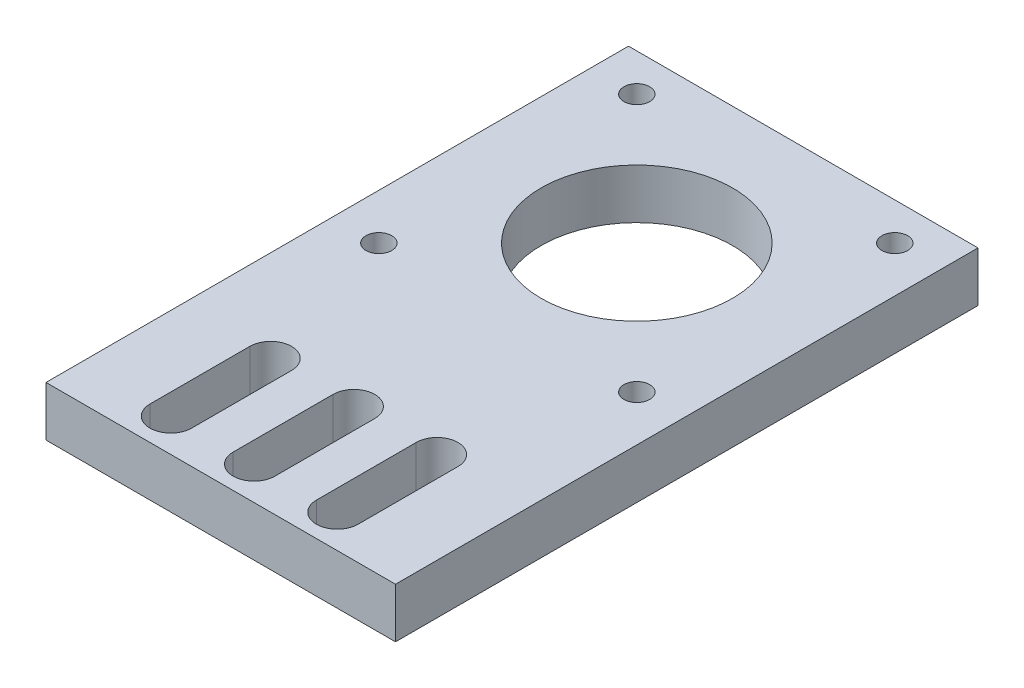
ISO-10303-21;
HEADER;
FILE_DESCRIPTION(('STEP AP214'),'2;1');
FILE_NAME('part.step','',(''),(''),'','','');
FILE_SCHEMA(('AUTOMOTIVE_DESIGN { 1 0 10303 214 1 1 1 1 }'));
ENDSEC;
DATA;
#1=APPLICATION_CONTEXT('core data for automotive mechanical design processes');
#2=APPLICATION_PROTOCOL_DEFINITION('international standard','automotive_design',2000,#1);
#3=PRODUCT_CONTEXT('',#1,'mechanical');
#4=PRODUCT('Part','Part','',(#3));
#5=PRODUCT_RELATED_PRODUCT_CATEGORY('part','',(#4));
#6=PRODUCT_DEFINITION_FORMATION('','',#4);
#7=PRODUCT_DEFINITION_CONTEXT('part definition',#1,'design');
#8=PRODUCT_DEFINITION('design','',#6,#7);
#9=PRODUCT_DEFINITION_SHAPE('','',#8);
#10=(LENGTH_UNIT() NAMED_UNIT(*) SI_UNIT(.MILLI.,.METRE.));
#11=(NAMED_UNIT(*) PLANE_ANGLE_UNIT() SI_UNIT($,.RADIAN.));
#12=(NAMED_UNIT(*) SI_UNIT($,.STERADIAN.) SOLID_ANGLE_UNIT());
#13=UNCERTAINTY_MEASURE_WITH_UNIT(LENGTH_MEASURE(1.E-05),#10,'distance_accuracy_value','');
#14=(GEOMETRIC_REPRESENTATION_CONTEXT(3) GLOBAL_UNCERTAINTY_ASSIGNED_CONTEXT((#13)) GLOBAL_UNIT_ASSIGNED_CONTEXT((#10,
#11,#12)) REPRESENTATION_CONTEXT('',''));
#15=CARTESIAN_POINT('',(0.,0.,0.));
#16=DIRECTION('',(0.,0.,1.));
#17=DIRECTION('',(1.,0.,0.));
#18=AXIS2_PLACEMENT_3D('',#15,#16,#17);
#19=CARTESIAN_POINT('',(0.,6.,0.));
#20=DIRECTION('',(0.,-1.,0.));
#21=DIRECTION('',(0.,0.,-1.));
#22=AXIS2_PLACEMENT_3D('',#19,#20,#21);
#23=PLANE('',#22);
#24=CARTESIAN_POINT('',(0.,6.,19.));
#25=DIRECTION('',(0.,1.,0.));
#26=DIRECTION('',(0.,0.,-1.));
#27=AXIS2_PLACEMENT_3D('',#24,#25,#26);
#28=CIRCLE('',#27,2.51);
#29=CARTESIAN_POINT('',(2.51,6.,19.));
#30=VERTEX_POINT('',#29);
#31=CARTESIAN_POINT('',(-2.51,6.,19.));
#32=VERTEX_POINT('',#31);
#33=EDGE_CURVE('E181',#30,#32,#28,.T.);
#34=ORIENTED_EDGE('',*,*,#33,.F.);
#35=DIRECTION('',(0.,0.,-1.));
#36=VECTOR('',#35,1.);
#37=CARTESIAN_POINT('',(2.51,6.,31.));
#38=LINE('',#37,#36);
#39=CARTESIAN_POINT('',(2.51,6.,31.));
#40=VERTEX_POINT('',#39);
#41=EDGE_CURVE('E189',#40,#30,#38,.T.);
#42=ORIENTED_EDGE('',*,*,#41,.F.);
#43=CARTESIAN_POINT('',(0.,6.,31.));
#44=DIRECTION('',(0.,1.,0.));
#45=DIRECTION('',(0.,0.,1.));
#46=AXIS2_PLACEMENT_3D('',#43,#44,#45);
#47=CIRCLE('',#46,2.51);
#48=CARTESIAN_POINT('',(-2.50999999999999,6.,31.));
#49=VERTEX_POINT('',#48);
#50=EDGE_CURVE('E186',#49,#40,#47,.T.);
#51=ORIENTED_EDGE('',*,*,#50,.F.);
#52=DIRECTION('',(0.,0.,1.));
#53=VECTOR('',#52,1.);
#54=CARTESIAN_POINT('',(-2.51,6.,31.));
#55=LINE('',#54,#53);
#56=EDGE_CURVE('E183',#32,#49,#55,.T.);
#57=ORIENTED_EDGE('',*,*,#56,.F.);
#58=EDGE_LOOP('',(#34,#42,#51,#57));
#59=FACE_BOUND('',#58,.T.);
#60=CARTESIAN_POINT('',(-15.5,6.,0.499999999999997));
#61=DIRECTION('',(0.,1.,0.));
#62=DIRECTION('',(0.,0.,1.));
#63=AXIS2_PLACEMENT_3D('',#60,#61,#62);
#64=CIRCLE('',#63,1.55);
#65=CARTESIAN_POINT('',(-15.5,6.,2.05));
#66=VERTEX_POINT('',#65);
#67=EDGE_CURVE('E243',#66,#66,#64,.T.);
#68=ORIENTED_EDGE('',*,*,#67,.F.);
#69=EDGE_LOOP('',(#68));
#70=FACE_BOUND('',#69,.T.);
#71=CARTESIAN_POINT('',(15.5,6.,0.499999999999994));
#72=DIRECTION('',(0.,1.,0.));
#73=DIRECTION('',(0.,0.,1.));
#74=AXIS2_PLACEMENT_3D('',#71,#72,#73);
#75=CIRCLE('',#74,1.55);
#76=CARTESIAN_POINT('',(15.5,6.,2.05));
#77=VERTEX_POINT('',#76);
#78=EDGE_CURVE('E249',#77,#77,#75,.T.);
#79=ORIENTED_EDGE('',*,*,#78,.F.);
#80=EDGE_LOOP('',(#79));
#81=FACE_BOUND('',#80,.T.);
#82=CARTESIAN_POINT('',(15.5,6.,-30.5));
#83=DIRECTION('',(0.,1.,0.));
#84=DIRECTION('',(0.,0.,1.));
#85=AXIS2_PLACEMENT_3D('',#82,#83,#84);
#86=CIRCLE('',#85,1.55);
#87=CARTESIAN_POINT('',(15.5,6.,-28.95));
#88=VERTEX_POINT('',#87);
#89=EDGE_CURVE('E255',#88,#88,#86,.T.);
#90=ORIENTED_EDGE('',*,*,#89,.F.);
#91=EDGE_LOOP('',(#90));
#92=FACE_BOUND('',#91,.T.);
#93=CARTESIAN_POINT('',(-15.5,6.,-30.5));
#94=DIRECTION('',(0.,1.,0.));
#95=DIRECTION('',(0.,0.,1.));
#96=AXIS2_PLACEMENT_3D('',#93,#94,#95);
#97=CIRCLE('',#96,1.55);
#98=CARTESIAN_POINT('',(-15.5,6.,-28.95));
#99=VERTEX_POINT('',#98);
#100=EDGE_CURVE('E261',#99,#99,#97,.T.);
#101=ORIENTED_EDGE('',*,*,#100,.F.);
#102=EDGE_LOOP('',(#101));
#103=FACE_BOUND('',#102,.T.);
#104=CARTESIAN_POINT('',(0.,6.,-15.));
#105=DIRECTION('',(0.,1.,0.));
#106=DIRECTION('',(0.,0.,1.));
#107=AXIS2_PLACEMENT_3D('',#104,#105,#106);
#108=CIRCLE('',#107,11.5);
#109=CARTESIAN_POINT('',(0.,6.,-3.49999999999999));
#110=VERTEX_POINT('',#109);
#111=EDGE_CURVE('E267',#110,#110,#108,.T.);
#112=ORIENTED_EDGE('',*,*,#111,.F.);
#113=EDGE_LOOP('',(#112));
#114=FACE_BOUND('',#113,.T.);
#115=DIRECTION('',(0.,0.,-1.));
#116=VECTOR('',#115,1.);
#117=CARTESIAN_POINT('',(21.,6.,35.));
#118=LINE('',#117,#116);
#119=CARTESIAN_POINT('',(21.,6.,35.));
#120=VERTEX_POINT('',#119);
#121=CARTESIAN_POINT('',(21.,6.,-35.));
#122=VERTEX_POINT('',#121);
#123=EDGE_CURVE('E273',#120,#122,#118,.T.);
#124=ORIENTED_EDGE('',*,*,#123,.T.);
#125=DIRECTION('',(-1.,0.,0.));
#126=VECTOR('',#125,1.);
#127=CARTESIAN_POINT('',(-21.,6.,-35.));
#128=LINE('',#127,#126);
#129=CARTESIAN_POINT('',(-21.,6.,-35.));
#130=VERTEX_POINT('',#129);
#131=EDGE_CURVE('E276',#122,#130,#128,.T.);
#132=ORIENTED_EDGE('',*,*,#131,.T.);
#133=DIRECTION('',(0.,0.,1.));
#134=VECTOR('',#133,1.);
#135=CARTESIAN_POINT('',(-21.,6.,35.));
#136=LINE('',#135,#134);
#137=CARTESIAN_POINT('',(-21.,6.,35.));
#138=VERTEX_POINT('',#137);
#139=EDGE_CURVE('E279',#130,#138,#136,.T.);
#140=ORIENTED_EDGE('',*,*,#139,.T.);
#141=DIRECTION('',(1.,0.,0.));
#142=VECTOR('',#141,1.);
#143=CARTESIAN_POINT('',(-21.,6.,35.));
#144=LINE('',#143,#142);
#145=EDGE_CURVE('E281',#138,#120,#144,.T.);
#146=ORIENTED_EDGE('',*,*,#145,.T.);
#147=EDGE_LOOP('',(#124,#132,#140,#146));
#148=FACE_BOUND('',#147,.T.);
#149=CARTESIAN_POINT('',(-9.99999999999999,6.,19.));
#150=DIRECTION('',(0.,1.,0.));
#151=DIRECTION('',(0.,0.,-1.));
#152=AXIS2_PLACEMENT_3D('',#149,#150,#151);
#153=CIRCLE('',#152,2.51);
#154=CARTESIAN_POINT('',(-7.49,6.,19.));
#155=VERTEX_POINT('',#154);
#156=CARTESIAN_POINT('',(-12.51,6.,19.));
#157=VERTEX_POINT('',#156);
#158=EDGE_CURVE('E212',#155,#157,#153,.T.);
#159=ORIENTED_EDGE('',*,*,#158,.F.);
#160=DIRECTION('',(0.,0.,-1.));
#161=VECTOR('',#160,1.);
#162=CARTESIAN_POINT('',(-7.49,6.,31.));
#163=LINE('',#162,#161);
#164=CARTESIAN_POINT('',(-7.49,6.,31.));
#165=VERTEX_POINT('',#164);
#166=EDGE_CURVE('E220',#165,#155,#163,.T.);
#167=ORIENTED_EDGE('',*,*,#166,.F.);
#168=CARTESIAN_POINT('',(-9.99999999999999,6.,31.));
#169=DIRECTION('',(0.,1.,0.));
#170=DIRECTION('',(0.,0.,1.));
#171=AXIS2_PLACEMENT_3D('',#168,#169,#170);
#172=CIRCLE('',#171,2.51);
#173=CARTESIAN_POINT('',(-12.51,6.,31.));
#174=VERTEX_POINT('',#173);
#175=EDGE_CURVE('E217',#174,#165,#172,.T.);
#176=ORIENTED_EDGE('',*,*,#175,.F.);
#177=DIRECTION('',(0.,0.,1.));
#178=VECTOR('',#177,1.);
#179=CARTESIAN_POINT('',(-12.51,6.,31.));
#180=LINE('',#179,#178);
#181=EDGE_CURVE('E214',#157,#174,#180,.T.);
#182=ORIENTED_EDGE('',*,*,#181,.F.);
#183=EDGE_LOOP('',(#159,#167,#176,#182));
#184=FACE_BOUND('',#183,.T.);
#185=CARTESIAN_POINT('',(10.,6.,19.));
#186=DIRECTION('',(0.,1.,0.));
#187=DIRECTION('',(0.,0.,-1.));
#188=AXIS2_PLACEMENT_3D('',#185,#186,#187);
#189=CIRCLE('',#188,2.51);
#190=CARTESIAN_POINT('',(12.51,6.,19.));
#191=VERTEX_POINT('',#190);
#192=CARTESIAN_POINT('',(7.49,6.,19.));
#193=VERTEX_POINT('',#192);
#194=EDGE_CURVE('E145',#191,#193,#189,.T.);
#195=ORIENTED_EDGE('',*,*,#194,.F.);
#196=DIRECTION('',(0.,0.,-1.));
#197=VECTOR('',#196,1.);
#198=CARTESIAN_POINT('',(12.51,6.,31.));
#199=LINE('',#198,#197);
#200=CARTESIAN_POINT('',(12.51,6.,31.));
#201=VERTEX_POINT('',#200);
#202=EDGE_CURVE('E167',#201,#191,#199,.T.);
#203=ORIENTED_EDGE('',*,*,#202,.F.);
#204=CARTESIAN_POINT('',(10.,6.,31.));
#205=DIRECTION('',(0.,1.,0.));
#206=DIRECTION('',(0.,0.,1.));
#207=AXIS2_PLACEMENT_3D('',#204,#205,#206);
#208=CIRCLE('',#207,2.51);
#209=CARTESIAN_POINT('',(7.49000000000001,6.,31.));
#210=VERTEX_POINT('',#209);
#211=EDGE_CURVE('E165',#210,#201,#208,.T.);
#212=ORIENTED_EDGE('',*,*,#211,.F.);
#213=DIRECTION('',(0.,0.,1.));
#214=VECTOR('',#213,1.);
#215=CARTESIAN_POINT('',(7.49,6.,31.));
#216=LINE('',#215,#214);
#217=EDGE_CURVE('E153',#193,#210,#216,.T.);
#218=ORIENTED_EDGE('',*,*,#217,.F.);
#219=EDGE_LOOP('',(#195,#203,#212,#218));
#220=FACE_BOUND('',#219,.T.);
#221=ADVANCED_FACE('F32',(#59,#70,#81,#92,#103,#114,#148,#184,#220),#23,.F.);
#222=CARTESIAN_POINT('',(0.,0.,0.));
#223=DIRECTION('',(0.,-1.,0.));
#224=DIRECTION('',(0.,0.,-1.));
#225=AXIS2_PLACEMENT_3D('',#222,#223,#224);
#226=PLANE('',#225);
#227=CARTESIAN_POINT('',(15.5,0.,0.499999999999994));
#228=DIRECTION('',(0.,1.,0.));
#229=DIRECTION('',(0.,0.,1.));
#230=AXIS2_PLACEMENT_3D('',#227,#228,#229);
#231=CIRCLE('',#230,1.55);
#232=CARTESIAN_POINT('',(15.5,0.,2.05));
#233=VERTEX_POINT('',#232);
#234=EDGE_CURVE('E246',#233,#233,#231,.T.);
#235=ORIENTED_EDGE('',*,*,#234,.T.);
#236=EDGE_LOOP('',(#235));
#237=FACE_BOUND('',#236,.T.);
#238=CARTESIAN_POINT('',(-15.5,0.,-30.5));
#239=DIRECTION('',(0.,1.,0.));
#240=DIRECTION('',(0.,0.,1.));
#241=AXIS2_PLACEMENT_3D('',#238,#239,#240);
#242=CIRCLE('',#241,1.55);
#243=CARTESIAN_POINT('',(-15.5,0.,-28.95));
#244=VERTEX_POINT('',#243);
#245=EDGE_CURVE('E258',#244,#244,#242,.T.);
#246=ORIENTED_EDGE('',*,*,#245,.T.);
#247=EDGE_LOOP('',(#246));
#248=FACE_BOUND('',#247,.T.);
#249=DIRECTION('',(0.,0.,-1.));
#250=VECTOR('',#249,1.);
#251=CARTESIAN_POINT('',(21.,0.,35.));
#252=LINE('',#251,#250);
#253=CARTESIAN_POINT('',(21.,0.,35.));
#254=VERTEX_POINT('',#253);
#255=CARTESIAN_POINT('',(21.,0.,-35.));
#256=VERTEX_POINT('',#255);
#257=EDGE_CURVE('E270',#254,#256,#252,.T.);
#258=ORIENTED_EDGE('',*,*,#257,.F.);
#259=DIRECTION('',(1.,0.,0.));
#260=VECTOR('',#259,1.);
#261=CARTESIAN_POINT('',(-21.,0.,35.));
#262=LINE('',#261,#260);
#263=CARTESIAN_POINT('',(-21.,0.,35.));
#264=VERTEX_POINT('',#263);
#265=EDGE_CURVE('E277',#264,#254,#262,.T.);
#266=ORIENTED_EDGE('',*,*,#265,.F.);
#267=DIRECTION('',(0.,0.,1.));
#268=VECTOR('',#267,1.);
#269=CARTESIAN_POINT('',(-21.,0.,35.));
#270=LINE('',#269,#268);
#271=CARTESIAN_POINT('',(-21.,0.,-35.));
#272=VERTEX_POINT('',#271);
#273=EDGE_CURVE('E288',#272,#264,#270,.T.);
#274=ORIENTED_EDGE('',*,*,#273,.F.);
#275=DIRECTION('',(-1.,0.,0.));
#276=VECTOR('',#275,1.);
#277=CARTESIAN_POINT('',(-21.,0.,-35.));
#278=LINE('',#277,#276);
#279=EDGE_CURVE('E286',#256,#272,#278,.T.);
#280=ORIENTED_EDGE('',*,*,#279,.F.);
#281=EDGE_LOOP('',(#258,#266,#274,#280));
#282=FACE_BOUND('',#281,.T.);
#283=CARTESIAN_POINT('',(0.,0.,-15.));
#284=DIRECTION('',(0.,1.,0.));
#285=DIRECTION('',(0.,0.,1.));
#286=AXIS2_PLACEMENT_3D('',#283,#284,#285);
#287=CIRCLE('',#286,11.5);
#288=CARTESIAN_POINT('',(0.,0.,-3.49999999999999));
#289=VERTEX_POINT('',#288);
#290=EDGE_CURVE('E264',#289,#289,#287,.T.);
#291=ORIENTED_EDGE('',*,*,#290,.T.);
#292=EDGE_LOOP('',(#291));
#293=FACE_BOUND('',#292,.T.);
#294=CARTESIAN_POINT('',(15.5,0.,-30.5));
#295=DIRECTION('',(0.,1.,0.));
#296=DIRECTION('',(0.,0.,1.));
#297=AXIS2_PLACEMENT_3D('',#294,#295,#296);
#298=CIRCLE('',#297,1.55);
#299=CARTESIAN_POINT('',(15.5,0.,-28.95));
#300=VERTEX_POINT('',#299);
#301=EDGE_CURVE('E252',#300,#300,#298,.T.);
#302=ORIENTED_EDGE('',*,*,#301,.T.);
#303=EDGE_LOOP('',(#302));
#304=FACE_BOUND('',#303,.T.);
#305=CARTESIAN_POINT('',(-15.5,0.,0.499999999999997));
#306=DIRECTION('',(0.,1.,0.));
#307=DIRECTION('',(0.,0.,1.));
#308=AXIS2_PLACEMENT_3D('',#305,#306,#307);
#309=CIRCLE('',#308,1.55);
#310=CARTESIAN_POINT('',(-15.5,0.,2.05));
#311=VERTEX_POINT('',#310);
#312=EDGE_CURVE('E242',#311,#311,#309,.T.);
#313=ORIENTED_EDGE('',*,*,#312,.T.);
#314=EDGE_LOOP('',(#313));
#315=FACE_BOUND('',#314,.T.);
#316=DIRECTION('',(0.,0.,-1.));
#317=VECTOR('',#316,1.);
#318=CARTESIAN_POINT('',(-7.49,0.,31.));
#319=LINE('',#318,#317);
#320=CARTESIAN_POINT('',(-7.48999999999999,0.,31.));
#321=VERTEX_POINT('',#320);
#322=CARTESIAN_POINT('',(-7.49,0.,19.));
#323=VERTEX_POINT('',#322);
#324=EDGE_CURVE('E215',#321,#323,#319,.T.);
#325=ORIENTED_EDGE('',*,*,#324,.T.);
#326=CARTESIAN_POINT('',(-9.99999999999999,0.,19.));
#327=DIRECTION('',(0.,1.,0.));
#328=DIRECTION('',(0.,0.,-1.));
#329=AXIS2_PLACEMENT_3D('',#326,#327,#328);
#330=CIRCLE('',#329,2.51);
#331=CARTESIAN_POINT('',(-12.51,0.,19.));
#332=VERTEX_POINT('',#331);
#333=EDGE_CURVE('E211',#323,#332,#330,.T.);
#334=ORIENTED_EDGE('',*,*,#333,.T.);
#335=DIRECTION('',(0.,0.,1.));
#336=VECTOR('',#335,1.);
#337=CARTESIAN_POINT('',(-12.51,0.,31.));
#338=LINE('',#337,#336);
#339=CARTESIAN_POINT('',(-12.51,0.,31.));
#340=VERTEX_POINT('',#339);
#341=EDGE_CURVE('E225',#332,#340,#338,.T.);
#342=ORIENTED_EDGE('',*,*,#341,.T.);
#343=CARTESIAN_POINT('',(-9.99999999999999,0.,31.));
#344=DIRECTION('',(0.,1.,0.));
#345=DIRECTION('',(0.,0.,1.));
#346=AXIS2_PLACEMENT_3D('',#343,#344,#345);
#347=CIRCLE('',#346,2.51);
#348=EDGE_CURVE('E228',#340,#321,#347,.T.);
#349=ORIENTED_EDGE('',*,*,#348,.T.);
#350=EDGE_LOOP('',(#325,#334,#342,#349));
#351=FACE_BOUND('',#350,.T.);
#352=DIRECTION('',(0.,0.,-1.));
#353=VECTOR('',#352,1.);
#354=CARTESIAN_POINT('',(2.51,0.,31.));
#355=LINE('',#354,#353);
#356=CARTESIAN_POINT('',(2.51,0.,31.));
#357=VERTEX_POINT('',#356);
#358=CARTESIAN_POINT('',(2.51,0.,19.));
#359=VERTEX_POINT('',#358);
#360=EDGE_CURVE('E184',#357,#359,#355,.T.);
#361=ORIENTED_EDGE('',*,*,#360,.T.);
#362=CARTESIAN_POINT('',(0.,0.,19.));
#363=DIRECTION('',(0.,1.,0.));
#364=DIRECTION('',(0.,0.,-1.));
#365=AXIS2_PLACEMENT_3D('',#362,#363,#364);
#366=CIRCLE('',#365,2.51);
#367=CARTESIAN_POINT('',(-2.51,0.,19.));
#368=VERTEX_POINT('',#367);
#369=EDGE_CURVE('E161',#359,#368,#366,.T.);
#370=ORIENTED_EDGE('',*,*,#369,.T.);
#371=DIRECTION('',(0.,0.,1.));
#372=VECTOR('',#371,1.);
#373=CARTESIAN_POINT('',(-2.51,0.,31.));
#374=LINE('',#373,#372);
#375=CARTESIAN_POINT('',(-2.50999999999999,0.,31.));
#376=VERTEX_POINT('',#375);
#377=EDGE_CURVE('E194',#368,#376,#374,.T.);
#378=ORIENTED_EDGE('',*,*,#377,.T.);
#379=CARTESIAN_POINT('',(0.,0.,31.));
#380=DIRECTION('',(0.,1.,0.));
#381=DIRECTION('',(0.,0.,1.));
#382=AXIS2_PLACEMENT_3D('',#379,#380,#381);
#383=CIRCLE('',#382,2.51);
#384=EDGE_CURVE('E197',#376,#357,#383,.T.);
#385=ORIENTED_EDGE('',*,*,#384,.T.);
#386=EDGE_LOOP('',(#361,#370,#378,#385));
#387=FACE_BOUND('',#386,.T.);
#388=DIRECTION('',(0.,0.,-1.));
#389=VECTOR('',#388,1.);
#390=CARTESIAN_POINT('',(12.51,0.,31.));
#391=LINE('',#390,#389);
#392=CARTESIAN_POINT('',(12.51,0.,31.));
#393=VERTEX_POINT('',#392);
#394=CARTESIAN_POINT('',(12.51,0.,19.));
#395=VERTEX_POINT('',#394);
#396=EDGE_CURVE('E154',#393,#395,#391,.T.);
#397=ORIENTED_EDGE('',*,*,#396,.T.);
#398=CARTESIAN_POINT('',(10.,0.,19.));
#399=DIRECTION('',(0.,1.,0.));
#400=DIRECTION('',(0.,0.,-1.));
#401=AXIS2_PLACEMENT_3D('',#398,#399,#400);
#402=CIRCLE('',#401,2.51);
#403=CARTESIAN_POINT('',(7.49,0.,19.));
#404=VERTEX_POINT('',#403);
#405=EDGE_CURVE('E55',#395,#404,#402,.T.);
#406=ORIENTED_EDGE('',*,*,#405,.T.);
#407=DIRECTION('',(0.,0.,1.));
#408=VECTOR('',#407,1.);
#409=CARTESIAN_POINT('',(7.49,0.,31.));
#410=LINE('',#409,#408);
#411=CARTESIAN_POINT('',(7.49000000000001,0.,31.));
#412=VERTEX_POINT('',#411);
#413=EDGE_CURVE('E160',#404,#412,#410,.T.);
#414=ORIENTED_EDGE('',*,*,#413,.T.);
#415=CARTESIAN_POINT('',(10.,0.,31.));
#416=DIRECTION('',(0.,1.,0.));
#417=DIRECTION('',(0.,0.,1.));
#418=AXIS2_PLACEMENT_3D('',#415,#416,#417);
#419=CIRCLE('',#418,2.51);
#420=EDGE_CURVE('E173',#412,#393,#419,.T.);
#421=ORIENTED_EDGE('',*,*,#420,.T.);
#422=EDGE_LOOP('',(#397,#406,#414,#421));
#423=FACE_BOUND('',#422,.T.);
#424=ADVANCED_FACE('F306',(#237,#248,#282,#293,#304,#315,#351,#387,#423),#226,.T.);
#425=CARTESIAN_POINT('',(21.,6.,35.));
#426=DIRECTION('',(-1.,0.,0.));
#427=DIRECTION('',(0.,0.,1.));
#428=AXIS2_PLACEMENT_3D('',#425,#426,#427);
#429=PLANE('',#428);
#430=ORIENTED_EDGE('',*,*,#257,.T.);
#431=DIRECTION('',(0.,-1.,0.));
#432=VECTOR('',#431,1.);
#433=CARTESIAN_POINT('',(21.,6.,-35.));
#434=LINE('',#433,#432);
#435=EDGE_CURVE('E11',#122,#256,#434,.T.);
#436=ORIENTED_EDGE('',*,*,#435,.F.);
#437=ORIENTED_EDGE('',*,*,#123,.F.);
#438=DIRECTION('',(0.,-1.,0.));
#439=VECTOR('',#438,1.);
#440=CARTESIAN_POINT('',(21.,6.,35.));
#441=LINE('',#440,#439);
#442=EDGE_CURVE('E283',#120,#254,#441,.T.);
#443=ORIENTED_EDGE('',*,*,#442,.T.);
#444=EDGE_LOOP('',(#430,#436,#437,#443));
#445=FACE_BOUND('',#444,.T.);
#446=ADVANCED_FACE('F34',(#445),#429,.F.);
#447=CARTESIAN_POINT('',(-21.,6.,-35.));
#448=DIRECTION('',(0.,0.,1.));
#449=DIRECTION('',(1.,0.,0.));
#450=AXIS2_PLACEMENT_3D('',#447,#448,#449);
#451=PLANE('',#450);
#452=ORIENTED_EDGE('',*,*,#279,.T.);
#453=DIRECTION('',(0.,-1.,0.));
#454=VECTOR('',#453,1.);
#455=CARTESIAN_POINT('',(-21.,6.,-35.));
#456=LINE('',#455,#454);
#457=EDGE_CURVE('E40',#130,#272,#456,.T.);
#458=ORIENTED_EDGE('',*,*,#457,.F.);
#459=ORIENTED_EDGE('',*,*,#131,.F.);
#460=ORIENTED_EDGE('',*,*,#435,.T.);
#461=EDGE_LOOP('',(#452,#458,#459,#460));
#462=FACE_BOUND('',#461,.T.);
#463=ADVANCED_FACE('F317',(#462),#451,.F.);
#464=CARTESIAN_POINT('',(-21.,6.,35.));
#465=DIRECTION('',(1.,0.,0.));
#466=DIRECTION('',(0.,0.,-1.));
#467=AXIS2_PLACEMENT_3D('',#464,#465,#466);
#468=PLANE('',#467);
#469=ORIENTED_EDGE('',*,*,#273,.T.);
#470=DIRECTION('',(0.,-1.,0.));
#471=VECTOR('',#470,1.);
#472=CARTESIAN_POINT('',(-21.,6.,35.));
#473=LINE('',#472,#471);
#474=EDGE_CURVE('E293',#138,#264,#473,.T.);
#475=ORIENTED_EDGE('',*,*,#474,.F.);
#476=ORIENTED_EDGE('',*,*,#139,.F.);
#477=ORIENTED_EDGE('',*,*,#457,.T.);
#478=EDGE_LOOP('',(#469,#475,#476,#477));
#479=FACE_BOUND('',#478,.T.);
#480=ADVANCED_FACE('F300',(#479),#468,.F.);
#481=CARTESIAN_POINT('',(-21.,6.,35.));
#482=DIRECTION('',(0.,0.,-1.));
#483=DIRECTION('',(-1.,0.,0.));
#484=AXIS2_PLACEMENT_3D('',#481,#482,#483);
#485=PLANE('',#484);
#486=ORIENTED_EDGE('',*,*,#265,.T.);
#487=ORIENTED_EDGE('',*,*,#442,.F.);
#488=ORIENTED_EDGE('',*,*,#145,.F.);
#489=ORIENTED_EDGE('',*,*,#474,.T.);
#490=EDGE_LOOP('',(#486,#487,#488,#489));
#491=FACE_BOUND('',#490,.T.);
#492=ADVANCED_FACE('F310',(#491),#485,.F.);
#493=CARTESIAN_POINT('',(0.,6.,-15.));
#494=DIRECTION('',(0.,-1.,0.));
#495=DIRECTION('',(0.,0.,-1.));
#496=AXIS2_PLACEMENT_3D('',#493,#494,#495);
#497=CYLINDRICAL_SURFACE('',#496,11.5);
#498=ORIENTED_EDGE('',*,*,#111,.T.);
#499=EDGE_LOOP('',(#498));
#500=FACE_BOUND('',#499,.T.);
#501=ORIENTED_EDGE('',*,*,#290,.F.);
#502=EDGE_LOOP('',(#501));
#503=FACE_BOUND('',#502,.T.);
#504=ADVANCED_FACE('F335',(#500,#503),#497,.F.);
#505=CARTESIAN_POINT('',(-15.5,6.,-30.5));
#506=DIRECTION('',(0.,-1.,0.));
#507=DIRECTION('',(0.,0.,-1.));
#508=AXIS2_PLACEMENT_3D('',#505,#506,#507);
#509=CYLINDRICAL_SURFACE('',#508,1.55);
#510=ORIENTED_EDGE('',*,*,#100,.T.);
#511=EDGE_LOOP('',(#510));
#512=FACE_BOUND('',#511,.T.);
#513=ORIENTED_EDGE('',*,*,#245,.F.);
#514=EDGE_LOOP('',(#513));
#515=FACE_BOUND('',#514,.T.);
#516=ADVANCED_FACE('F342',(#512,#515),#509,.F.);
#517=CARTESIAN_POINT('',(15.5,6.,-30.5));
#518=DIRECTION('',(0.,-1.,0.));
#519=DIRECTION('',(0.,0.,-1.));
#520=AXIS2_PLACEMENT_3D('',#517,#518,#519);
#521=CYLINDRICAL_SURFACE('',#520,1.55);
#522=ORIENTED_EDGE('',*,*,#89,.T.);
#523=EDGE_LOOP('',(#522));
#524=FACE_BOUND('',#523,.T.);
#525=ORIENTED_EDGE('',*,*,#301,.F.);
#526=EDGE_LOOP('',(#525));
#527=FACE_BOUND('',#526,.T.);
#528=ADVANCED_FACE('F347',(#524,#527),#521,.F.);
#529=CARTESIAN_POINT('',(15.5,6.,0.499999999999994));
#530=DIRECTION('',(0.,-1.,0.));
#531=DIRECTION('',(0.,0.,-1.));
#532=AXIS2_PLACEMENT_3D('',#529,#530,#531);
#533=CYLINDRICAL_SURFACE('',#532,1.55);
#534=ORIENTED_EDGE('',*,*,#78,.T.);
#535=EDGE_LOOP('',(#534));
#536=FACE_BOUND('',#535,.T.);
#537=ORIENTED_EDGE('',*,*,#234,.F.);
#538=EDGE_LOOP('',(#537));
#539=FACE_BOUND('',#538,.T.);
#540=ADVANCED_FACE('F411',(#536,#539),#533,.F.);
#541=CARTESIAN_POINT('',(-15.5,6.,0.499999999999997));
#542=DIRECTION('',(0.,-1.,0.));
#543=DIRECTION('',(0.,0.,-1.));
#544=AXIS2_PLACEMENT_3D('',#541,#542,#543);
#545=CYLINDRICAL_SURFACE('',#544,1.55);
#546=ORIENTED_EDGE('',*,*,#67,.T.);
#547=EDGE_LOOP('',(#546));
#548=FACE_BOUND('',#547,.T.);
#549=ORIENTED_EDGE('',*,*,#312,.F.);
#550=EDGE_LOOP('',(#549));
#551=FACE_BOUND('',#550,.T.);
#552=ADVANCED_FACE('F407',(#548,#551),#545,.F.);
#553=CARTESIAN_POINT('',(-9.99999999999999,6.,19.));
#554=DIRECTION('',(0.,-1.,0.));
#555=DIRECTION('',(0.,0.,-1.));
#556=AXIS2_PLACEMENT_3D('',#553,#554,#555);
#557=CYLINDRICAL_SURFACE('',#556,2.51);
#558=ORIENTED_EDGE('',*,*,#333,.F.);
#559=DIRECTION('',(0.,-1.,0.));
#560=VECTOR('',#559,1.);
#561=CARTESIAN_POINT('',(-7.49,6.,19.));
#562=LINE('',#561,#560);
#563=EDGE_CURVE('E222',#155,#323,#562,.T.);
#564=ORIENTED_EDGE('',*,*,#563,.F.);
#565=ORIENTED_EDGE('',*,*,#158,.T.);
#566=DIRECTION('',(0.,-1.,0.));
#567=VECTOR('',#566,1.);
#568=CARTESIAN_POINT('',(-12.51,6.,19.));
#569=LINE('',#568,#567);
#570=EDGE_CURVE('E239',#157,#332,#569,.T.);
#571=ORIENTED_EDGE('',*,*,#570,.T.);
#572=EDGE_LOOP('',(#558,#564,#565,#571));
#573=FACE_BOUND('',#572,.T.);
#574=ADVANCED_FACE('F403',(#573),#557,.F.);
#575=CARTESIAN_POINT('',(-12.51,6.,31.));
#576=DIRECTION('',(1.,0.,0.));
#577=DIRECTION('',(0.,0.,-1.));
#578=AXIS2_PLACEMENT_3D('',#575,#576,#577);
#579=PLANE('',#578);
#580=ORIENTED_EDGE('',*,*,#341,.F.);
#581=ORIENTED_EDGE('',*,*,#570,.F.);
#582=ORIENTED_EDGE('',*,*,#181,.T.);
#583=DIRECTION('',(0.,-1.,0.));
#584=VECTOR('',#583,1.);
#585=CARTESIAN_POINT('',(-12.51,6.,31.));
#586=LINE('',#585,#584);
#587=EDGE_CURVE('E237',#174,#340,#586,.T.);
#588=ORIENTED_EDGE('',*,*,#587,.T.);
#589=EDGE_LOOP('',(#580,#581,#582,#588));
#590=FACE_BOUND('',#589,.T.);
#591=ADVANCED_FACE('F399',(#590),#579,.T.);
#592=CARTESIAN_POINT('',(-9.99999999999999,6.,31.));
#593=DIRECTION('',(0.,-1.,0.));
#594=DIRECTION('',(0.,0.,-1.));
#595=AXIS2_PLACEMENT_3D('',#592,#593,#594);
#596=CYLINDRICAL_SURFACE('',#595,2.51);
#597=ORIENTED_EDGE('',*,*,#348,.F.);
#598=ORIENTED_EDGE('',*,*,#587,.F.);
#599=ORIENTED_EDGE('',*,*,#175,.T.);
#600=DIRECTION('',(0.,-1.,0.));
#601=VECTOR('',#600,1.);
#602=CARTESIAN_POINT('',(-7.48999999999999,6.,31.));
#603=LINE('',#602,#601);
#604=EDGE_CURVE('E235',#165,#321,#603,.T.);
#605=ORIENTED_EDGE('',*,*,#604,.T.);
#606=EDGE_LOOP('',(#597,#598,#599,#605));
#607=FACE_BOUND('',#606,.T.);
#608=ADVANCED_FACE('F395',(#607),#596,.F.);
#609=CARTESIAN_POINT('',(-7.49,6.,31.));
#610=DIRECTION('',(-1.,0.,0.));
#611=DIRECTION('',(0.,0.,1.));
#612=AXIS2_PLACEMENT_3D('',#609,#610,#611);
#613=PLANE('',#612);
#614=ORIENTED_EDGE('',*,*,#324,.F.);
#615=ORIENTED_EDGE('',*,*,#604,.F.);
#616=ORIENTED_EDGE('',*,*,#166,.T.);
#617=ORIENTED_EDGE('',*,*,#563,.T.);
#618=EDGE_LOOP('',(#614,#615,#616,#617));
#619=FACE_BOUND('',#618,.T.);
#620=ADVANCED_FACE('F391',(#619),#613,.T.);
#621=CARTESIAN_POINT('',(0.,6.,19.));
#622=DIRECTION('',(0.,-1.,0.));
#623=DIRECTION('',(0.,0.,-1.));
#624=AXIS2_PLACEMENT_3D('',#621,#622,#623);
#625=CYLINDRICAL_SURFACE('',#624,2.51);
#626=ORIENTED_EDGE('',*,*,#369,.F.);
#627=DIRECTION('',(0.,-1.,0.));
#628=VECTOR('',#627,1.);
#629=CARTESIAN_POINT('',(2.51,6.,19.));
#630=LINE('',#629,#628);
#631=EDGE_CURVE('E191',#30,#359,#630,.T.);
#632=ORIENTED_EDGE('',*,*,#631,.F.);
#633=ORIENTED_EDGE('',*,*,#33,.T.);
#634=DIRECTION('',(0.,-1.,0.));
#635=VECTOR('',#634,1.);
#636=CARTESIAN_POINT('',(-2.51,6.,19.));
#637=LINE('',#636,#635);
#638=EDGE_CURVE('E208',#32,#368,#637,.T.);
#639=ORIENTED_EDGE('',*,*,#638,.T.);
#640=EDGE_LOOP('',(#626,#632,#633,#639));
#641=FACE_BOUND('',#640,.T.);
#642=ADVANCED_FACE('F387',(#641),#625,.F.);
#643=CARTESIAN_POINT('',(-2.51,6.,31.));
#644=DIRECTION('',(1.,0.,0.));
#645=DIRECTION('',(0.,0.,-1.));
#646=AXIS2_PLACEMENT_3D('',#643,#644,#645);
#647=PLANE('',#646);
#648=ORIENTED_EDGE('',*,*,#377,.F.);
#649=ORIENTED_EDGE('',*,*,#638,.F.);
#650=ORIENTED_EDGE('',*,*,#56,.T.);
#651=DIRECTION('',(0.,-1.,0.));
#652=VECTOR('',#651,1.);
#653=CARTESIAN_POINT('',(-2.50999999999999,6.,31.));
#654=LINE('',#653,#652);
#655=EDGE_CURVE('E206',#49,#376,#654,.T.);
#656=ORIENTED_EDGE('',*,*,#655,.T.);
#657=EDGE_LOOP('',(#648,#649,#650,#656));
#658=FACE_BOUND('',#657,.T.);
#659=ADVANCED_FACE('F383',(#658),#647,.T.);
#660=CARTESIAN_POINT('',(0.,6.,31.));
#661=DIRECTION('',(0.,-1.,0.));
#662=DIRECTION('',(0.,0.,-1.));
#663=AXIS2_PLACEMENT_3D('',#660,#661,#662);
#664=CYLINDRICAL_SURFACE('',#663,2.51);
#665=ORIENTED_EDGE('',*,*,#384,.F.);
#666=ORIENTED_EDGE('',*,*,#655,.F.);
#667=ORIENTED_EDGE('',*,*,#50,.T.);
#668=DIRECTION('',(0.,-1.,0.));
#669=VECTOR('',#668,1.);
#670=CARTESIAN_POINT('',(2.51,6.,31.));
#671=LINE('',#670,#669);
#672=EDGE_CURVE('E204',#40,#357,#671,.T.);
#673=ORIENTED_EDGE('',*,*,#672,.T.);
#674=EDGE_LOOP('',(#665,#666,#667,#673));
#675=FACE_BOUND('',#674,.T.);
#676=ADVANCED_FACE('F379',(#675),#664,.F.);
#677=CARTESIAN_POINT('',(2.51,6.,31.));
#678=DIRECTION('',(-1.,0.,0.));
#679=DIRECTION('',(0.,0.,1.));
#680=AXIS2_PLACEMENT_3D('',#677,#678,#679);
#681=PLANE('',#680);
#682=ORIENTED_EDGE('',*,*,#360,.F.);
#683=ORIENTED_EDGE('',*,*,#672,.F.);
#684=ORIENTED_EDGE('',*,*,#41,.T.);
#685=ORIENTED_EDGE('',*,*,#631,.T.);
#686=EDGE_LOOP('',(#682,#683,#684,#685));
#687=FACE_BOUND('',#686,.T.);
#688=ADVANCED_FACE('F376',(#687),#681,.T.);
#689=CARTESIAN_POINT('',(10.,6.,19.));
#690=DIRECTION('',(0.,-1.,0.));
#691=DIRECTION('',(0.,0.,-1.));
#692=AXIS2_PLACEMENT_3D('',#689,#690,#691);
#693=CYLINDRICAL_SURFACE('',#692,2.51);
#694=ORIENTED_EDGE('',*,*,#405,.F.);
#695=DIRECTION('',(0.,-1.,0.));
#696=VECTOR('',#695,1.);
#697=CARTESIAN_POINT('',(12.51,6.,19.));
#698=LINE('',#697,#696);
#699=EDGE_CURVE('E149',#191,#395,#698,.T.);
#700=ORIENTED_EDGE('',*,*,#699,.F.);
#701=ORIENTED_EDGE('',*,*,#194,.T.);
#702=DIRECTION('',(0.,-1.,0.));
#703=VECTOR('',#702,1.);
#704=CARTESIAN_POINT('',(7.49,6.,19.));
#705=LINE('',#704,#703);
#706=EDGE_CURVE('E148',#193,#404,#705,.T.);
#707=ORIENTED_EDGE('',*,*,#706,.T.);
#708=EDGE_LOOP('',(#694,#700,#701,#707));
#709=FACE_BOUND('',#708,.T.);
#710=ADVANCED_FACE('F147',(#709),#693,.F.);
#711=CARTESIAN_POINT('',(7.49,6.,31.));
#712=DIRECTION('',(1.,0.,0.));
#713=DIRECTION('',(0.,0.,-1.));
#714=AXIS2_PLACEMENT_3D('',#711,#712,#713);
#715=PLANE('',#714);
#716=ORIENTED_EDGE('',*,*,#413,.F.);
#717=ORIENTED_EDGE('',*,*,#706,.F.);
#718=ORIENTED_EDGE('',*,*,#217,.T.);
#719=DIRECTION('',(0.,-1.,0.));
#720=VECTOR('',#719,1.);
#721=CARTESIAN_POINT('',(7.49000000000001,6.,31.));
#722=LINE('',#721,#720);
#723=EDGE_CURVE('E162',#210,#412,#722,.T.);
#724=ORIENTED_EDGE('',*,*,#723,.T.);
#725=EDGE_LOOP('',(#716,#717,#718,#724));
#726=FACE_BOUND('',#725,.T.);
#727=ADVANCED_FACE('F157',(#726),#715,.T.);
#728=CARTESIAN_POINT('',(10.,6.,31.));
#729=DIRECTION('',(0.,-1.,0.));
#730=DIRECTION('',(0.,0.,-1.));
#731=AXIS2_PLACEMENT_3D('',#728,#729,#730);
#732=CYLINDRICAL_SURFACE('',#731,2.51);
#733=ORIENTED_EDGE('',*,*,#420,.F.);
#734=ORIENTED_EDGE('',*,*,#723,.F.);
#735=ORIENTED_EDGE('',*,*,#211,.T.);
#736=DIRECTION('',(0.,-1.,0.));
#737=VECTOR('',#736,1.);
#738=CARTESIAN_POINT('',(12.51,6.,31.));
#739=LINE('',#738,#737);
#740=EDGE_CURVE('E47',#201,#393,#739,.T.);
#741=ORIENTED_EDGE('',*,*,#740,.T.);
#742=EDGE_LOOP('',(#733,#734,#735,#741));
#743=FACE_BOUND('',#742,.T.);
#744=ADVANCED_FACE('F364',(#743),#732,.F.);
#745=CARTESIAN_POINT('',(12.51,6.,31.));
#746=DIRECTION('',(-1.,0.,0.));
#747=DIRECTION('',(0.,0.,1.));
#748=AXIS2_PLACEMENT_3D('',#745,#746,#747);
#749=PLANE('',#748);
#750=ORIENTED_EDGE('',*,*,#396,.F.);
#751=ORIENTED_EDGE('',*,*,#740,.F.);
#752=ORIENTED_EDGE('',*,*,#202,.T.);
#753=ORIENTED_EDGE('',*,*,#699,.T.);
#754=EDGE_LOOP('',(#750,#751,#752,#753));
#755=FACE_BOUND('',#754,.T.);
#756=ADVANCED_FACE('F362',(#755),#749,.T.);
#757=CLOSED_SHELL('',(#221,#424,#446,#463,#480,#492,#504,#516,#528,#540,#552,#574,#591,#608,
#620,#642,#659,#676,#688,#710,#727,#744,#756));
#758=MANIFOLD_SOLID_BREP('B2',#757);
#759=ADVANCED_BREP_SHAPE_REPRESENTATION('',(#18,#758),#14);
#760=SHAPE_DEFINITION_REPRESENTATION(#9,#759);
ENDSEC;
END-ISO-10303-21;
